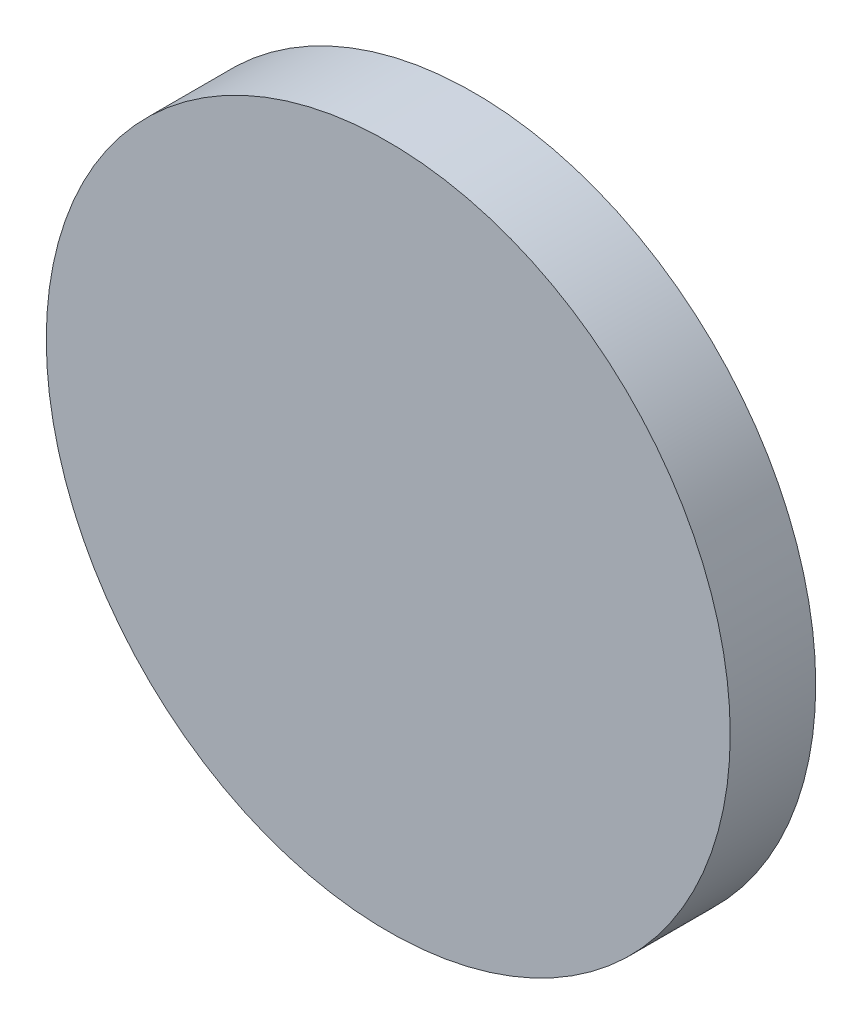
ISO-10303-21;
HEADER;
FILE_DESCRIPTION(('STEP AP214'),'2;1');
FILE_NAME('part.step','',(''),(''),'','','');
FILE_SCHEMA(('AUTOMOTIVE_DESIGN { 1 0 10303 214 1 1 1 1 }'));
ENDSEC;
DATA;
#1=APPLICATION_CONTEXT('core data for automotive mechanical design processes');
#2=APPLICATION_PROTOCOL_DEFINITION('international standard','automotive_design',2000,#1);
#3=PRODUCT_CONTEXT('',#1,'mechanical');
#4=PRODUCT('Part','Part','',(#3));
#5=PRODUCT_RELATED_PRODUCT_CATEGORY('part','',(#4));
#6=PRODUCT_DEFINITION_FORMATION('','',#4);
#7=PRODUCT_DEFINITION_CONTEXT('part definition',#1,'design');
#8=PRODUCT_DEFINITION('design','',#6,#7);
#9=PRODUCT_DEFINITION_SHAPE('','',#8);
#10=(LENGTH_UNIT() NAMED_UNIT(*) SI_UNIT(.MILLI.,.METRE.));
#11=(NAMED_UNIT(*) PLANE_ANGLE_UNIT() SI_UNIT($,.RADIAN.));
#12=(NAMED_UNIT(*) SI_UNIT($,.STERADIAN.) SOLID_ANGLE_UNIT());
#13=UNCERTAINTY_MEASURE_WITH_UNIT(LENGTH_MEASURE(1.E-05),#10,'distance_accuracy_value','');
#14=(GEOMETRIC_REPRESENTATION_CONTEXT(3) GLOBAL_UNCERTAINTY_ASSIGNED_CONTEXT((#13)) GLOBAL_UNIT_ASSIGNED_CONTEXT((#10,
#11,#12)) REPRESENTATION_CONTEXT('',''));
#15=CARTESIAN_POINT('',(0.,0.,0.));
#16=DIRECTION('',(0.,0.,1.));
#17=DIRECTION('',(1.,0.,0.));
#18=AXIS2_PLACEMENT_3D('',#15,#16,#17);
#19=CARTESIAN_POINT('',(0.,0.,3.5));
#20=DIRECTION('',(0.,0.,-1.));
#21=DIRECTION('',(-1.,0.,0.));
#22=AXIS2_PLACEMENT_3D('',#19,#20,#21);
#23=CYLINDRICAL_SURFACE('',#22,14.);
#24=CARTESIAN_POINT('',(0.,0.,3.5));
#25=DIRECTION('',(0.,0.,1.));
#26=DIRECTION('',(1.,0.,0.));
#27=AXIS2_PLACEMENT_3D('',#24,#25,#26);
#28=CIRCLE('',#27,14.);
#29=CARTESIAN_POINT('',(14.,0.,3.5));
#30=VERTEX_POINT('',#29);
#31=EDGE_CURVE('E10',#30,#30,#28,.T.);
#32=ORIENTED_EDGE('',*,*,#31,.F.);
#33=EDGE_LOOP('',(#32));
#34=FACE_BOUND('',#33,.T.);
#35=CARTESIAN_POINT('',(0.,0.,0.));
#36=DIRECTION('',(0.,0.,1.));
#37=DIRECTION('',(1.,0.,0.));
#38=AXIS2_PLACEMENT_3D('',#35,#36,#37);
#39=CIRCLE('',#38,14.);
#40=CARTESIAN_POINT('',(14.,0.,0.));
#41=VERTEX_POINT('',#40);
#42=EDGE_CURVE('E35',#41,#41,#39,.T.);
#43=ORIENTED_EDGE('',*,*,#42,.T.);
#44=EDGE_LOOP('',(#43));
#45=FACE_BOUND('',#44,.T.);
#46=ADVANCED_FACE('F32',(#34,#45),#23,.T.);
#47=CARTESIAN_POINT('',(0.,0.,3.5));
#48=DIRECTION('',(0.,0.,1.));
#49=DIRECTION('',(1.,0.,0.));
#50=AXIS2_PLACEMENT_3D('',#47,#48,#49);
#51=PLANE('',#50);
#52=ORIENTED_EDGE('',*,*,#31,.T.);
#53=EDGE_LOOP('',(#52));
#54=FACE_BOUND('',#53,.T.);
#55=ADVANCED_FACE('F47',(#54),#51,.T.);
#56=CARTESIAN_POINT('',(0.,0.,0.));
#57=DIRECTION('',(0.,0.,1.));
#58=DIRECTION('',(1.,0.,0.));
#59=AXIS2_PLACEMENT_3D('',#56,#57,#58);
#60=PLANE('',#59);
#61=ORIENTED_EDGE('',*,*,#42,.F.);
#62=EDGE_LOOP('',(#61));
#63=FACE_BOUND('',#62,.T.);
#64=ADVANCED_FACE('F45',(#63),#60,.F.);
#65=CLOSED_SHELL('',(#46,#55,#64));
#66=MANIFOLD_SOLID_BREP('B2',#65);
#67=ADVANCED_BREP_SHAPE_REPRESENTATION('',(#18,#66),#14);
#68=SHAPE_DEFINITION_REPRESENTATION(#9,#67);
ENDSEC;
END-ISO-10303-21;
